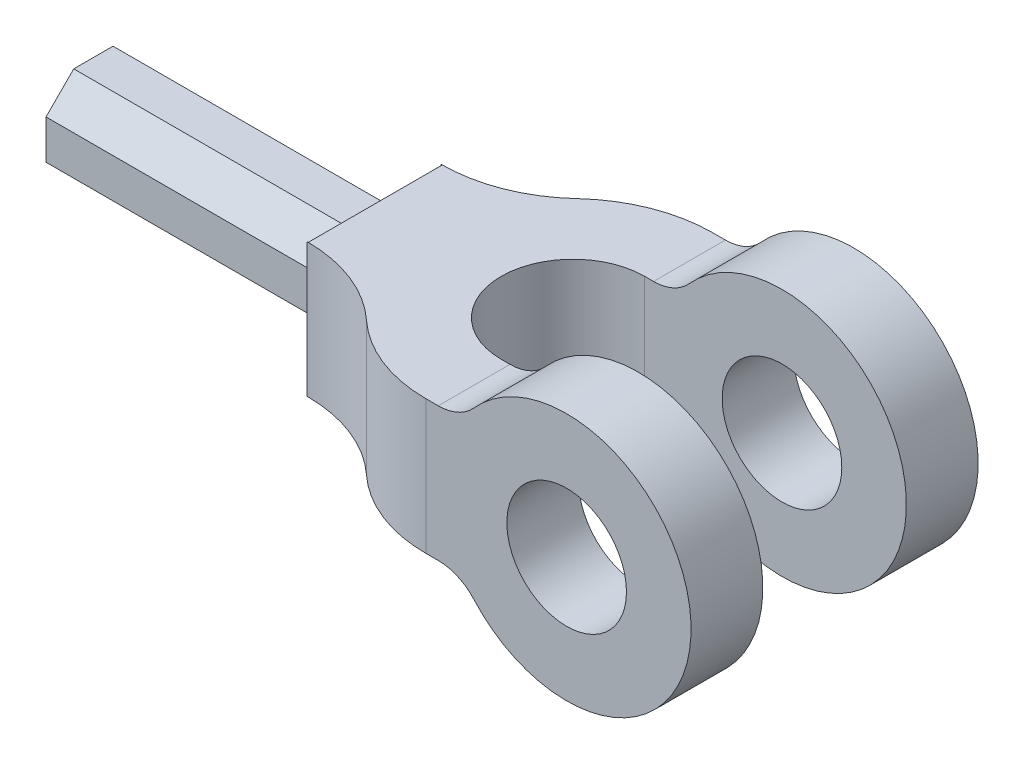
ISO-10303-21;
HEADER;
FILE_DESCRIPTION(('STEP AP214'),'2;1');
FILE_NAME('part.step','',(''),(''),'','','');
FILE_SCHEMA(('AUTOMOTIVE_DESIGN { 1 0 10303 214 1 1 1 1 }'));
ENDSEC;
DATA;
#1=APPLICATION_CONTEXT('core data for automotive mechanical design processes');
#2=APPLICATION_PROTOCOL_DEFINITION('international standard','automotive_design',2000,#1);
#3=PRODUCT_CONTEXT('',#1,'mechanical');
#4=PRODUCT('Part','Part','',(#3));
#5=PRODUCT_RELATED_PRODUCT_CATEGORY('part','',(#4));
#6=PRODUCT_DEFINITION_FORMATION('','',#4);
#7=PRODUCT_DEFINITION_CONTEXT('part definition',#1,'design');
#8=PRODUCT_DEFINITION('design','',#6,#7);
#9=PRODUCT_DEFINITION_SHAPE('','',#8);
#10=(LENGTH_UNIT() NAMED_UNIT(*) SI_UNIT(.MILLI.,.METRE.));
#11=(NAMED_UNIT(*) PLANE_ANGLE_UNIT() SI_UNIT($,.RADIAN.));
#12=(NAMED_UNIT(*) SI_UNIT($,.STERADIAN.) SOLID_ANGLE_UNIT());
#13=UNCERTAINTY_MEASURE_WITH_UNIT(LENGTH_MEASURE(1.E-05),#10,'distance_accuracy_value','');
#14=(GEOMETRIC_REPRESENTATION_CONTEXT(3) GLOBAL_UNCERTAINTY_ASSIGNED_CONTEXT((#13)) GLOBAL_UNIT_ASSIGNED_CONTEXT((#10,
#11,#12)) REPRESENTATION_CONTEXT('',''));
#15=CARTESIAN_POINT('',(0.,0.,0.));
#16=DIRECTION('',(0.,0.,1.));
#17=DIRECTION('',(1.,0.,0.));
#18=AXIS2_PLACEMENT_3D('',#15,#16,#17);
#19=CARTESIAN_POINT('',(0.,-14.000000000005,-60.));
#20=DIRECTION('',(0.,-1.,0.));
#21=DIRECTION('',(1.,0.,0.));
#22=AXIS2_PLACEMENT_3D('',#19,#20,#21);
#23=PLANE('',#22);
#24=DIRECTION('',(-1.,0.,0.));
#25=VECTOR('',#24,1.);
#26=CARTESIAN_POINT('',(60.,-14.000000000005,-44.));
#27=LINE('',#26,#25);
#28=CARTESIAN_POINT('',(60.,-14.000000000005,-44.));
#29=VERTEX_POINT('',#28);
#30=CARTESIAN_POINT('',(59.7773737746571,-14.000000000005,-44.));
#31=VERTEX_POINT('',#30);
#32=EDGE_CURVE('E294',#29,#31,#27,.T.);
#33=ORIENTED_EDGE('',*,*,#32,.T.);
#34=CARTESIAN_POINT('',(59.7773737746571,-14.000000000005,-74.));
#35=DIRECTION('',(0.,-1.,0.));
#36=DIRECTION('',(1.,0.,0.));
#37=AXIS2_PLACEMENT_3D('',#34,#35,#36);
#38=CIRCLE('',#37,30.);
#39=CARTESIAN_POINT('',(80.1734518290282,-14.000000000005,-52.));
#40=VERTEX_POINT('',#39);
#41=EDGE_CURVE('E407',#31,#40,#38,.F.);
#42=ORIENTED_EDGE('',*,*,#41,.T.);
#43=CARTESIAN_POINT('',(100.569529883399,-14.000000000005,-30.));
#44=DIRECTION('',(0.,-1.,0.));
#45=DIRECTION('',(1.,0.,0.));
#46=AXIS2_PLACEMENT_3D('',#43,#44,#45);
#47=CIRCLE('',#46,30.);
#48=CARTESIAN_POINT('',(100.569529883399,-14.000000000005,-60.));
#49=VERTEX_POINT('',#48);
#50=EDGE_CURVE('E58',#40,#49,#47,.T.);
#51=ORIENTED_EDGE('',*,*,#50,.T.);
#52=DIRECTION('',(1.,0.,0.));
#53=VECTOR('',#52,1.);
#54=CARTESIAN_POINT('',(0.,-14.000000000005,-60.));
#55=LINE('',#54,#53);
#56=CARTESIAN_POINT('',(103.167184270005,-14.000000000005,-60.));
#57=VERTEX_POINT('',#56);
#58=EDGE_CURVE('E358',#49,#57,#55,.T.);
#59=ORIENTED_EDGE('',*,*,#58,.T.);
#60=DIRECTION('',(0.,0.,1.));
#61=VECTOR('',#60,1.);
#62=CARTESIAN_POINT('',(103.167184270005,-14.000000000005,-60.));
#63=LINE('',#62,#61);
#64=CARTESIAN_POINT('',(103.167184270005,-14.000000000005,-45.));
#65=VERTEX_POINT('',#64);
#66=EDGE_CURVE('E373',#57,#65,#63,.T.);
#67=ORIENTED_EDGE('',*,*,#66,.T.);
#68=DIRECTION('',(-1.,0.,0.));
#69=VECTOR('',#68,1.);
#70=CARTESIAN_POINT('',(0.,-14.000000000005,-45.));
#71=LINE('',#70,#69);
#72=CARTESIAN_POINT('',(101.3103720975,-14.000000000005,-45.));
#73=VERTEX_POINT('',#72);
#74=EDGE_CURVE('E325',#65,#73,#71,.T.);
#75=ORIENTED_EDGE('',*,*,#74,.T.);
#76=CARTESIAN_POINT('',(101.3103720975,-14.000000000005,-30.));
#77=DIRECTION('',(0.,-1.,0.));
#78=DIRECTION('',(1.,0.,0.));
#79=AXIS2_PLACEMENT_3D('',#76,#77,#78);
#80=CIRCLE('',#79,15.);
#81=CARTESIAN_POINT('',(101.3103720975,-14.000000000005,-15.));
#82=VERTEX_POINT('',#81);
#83=EDGE_CURVE('E336',#82,#73,#80,.T.);
#84=ORIENTED_EDGE('',*,*,#83,.F.);
#85=DIRECTION('',(-1.,0.,0.));
#86=VECTOR('',#85,1.);
#87=CARTESIAN_POINT('',(0.,-14.000000000005,-15.));
#88=LINE('',#87,#86);
#89=CARTESIAN_POINT('',(103.167184270005,-14.000000000005,-15.));
#90=VERTEX_POINT('',#89);
#91=EDGE_CURVE('E314',#90,#82,#88,.T.);
#92=ORIENTED_EDGE('',*,*,#91,.F.);
#93=CARTESIAN_POINT('',(103.167184270005,-14.000000000005,0.));
#94=VERTEX_POINT('',#93);
#95=EDGE_CURVE('E377',#90,#94,#63,.T.);
#96=ORIENTED_EDGE('',*,*,#95,.T.);
#97=DIRECTION('',(1.,0.,0.));
#98=VECTOR('',#97,1.);
#99=CARTESIAN_POINT('',(0.,-14.000000000005,0.));
#100=LINE('',#99,#98);
#101=CARTESIAN_POINT('',(100.569529883399,-14.000000000005,0.));
#102=VERTEX_POINT('',#101);
#103=EDGE_CURVE('E349',#102,#94,#100,.T.);
#104=ORIENTED_EDGE('',*,*,#103,.F.);
#105=CARTESIAN_POINT('',(100.569529883399,-14.000000000005,-30.));
#106=DIRECTION('',(0.,-1.,0.));
#107=DIRECTION('',(1.,0.,0.));
#108=AXIS2_PLACEMENT_3D('',#105,#106,#107);
#109=CIRCLE('',#108,30.);
#110=CARTESIAN_POINT('',(80.1734518290282,-14.000000000005,-7.99999999999999));
#111=VERTEX_POINT('',#110);
#112=EDGE_CURVE('E419',#102,#111,#109,.T.);
#113=ORIENTED_EDGE('',*,*,#112,.T.);
#114=CARTESIAN_POINT('',(59.777373774657,-14.000000000005,14.));
#115=DIRECTION('',(0.,-1.,0.));
#116=DIRECTION('',(1.,0.,0.));
#117=AXIS2_PLACEMENT_3D('',#114,#115,#116);
#118=CIRCLE('',#117,30.);
#119=CARTESIAN_POINT('',(59.777373774657,-14.000000000005,-16.));
#120=VERTEX_POINT('',#119);
#121=EDGE_CURVE('E401',#111,#120,#118,.F.);
#122=ORIENTED_EDGE('',*,*,#121,.T.);
#123=DIRECTION('',(-1.,0.,0.));
#124=VECTOR('',#123,1.);
#125=CARTESIAN_POINT('',(60.,-14.000000000005,-16.));
#126=LINE('',#125,#124);
#127=CARTESIAN_POINT('',(60.,-14.000000000005,-16.));
#128=VERTEX_POINT('',#127);
#129=EDGE_CURVE('E301',#128,#120,#126,.T.);
#130=ORIENTED_EDGE('',*,*,#129,.F.);
#131=DIRECTION('',(0.,0.,1.));
#132=VECTOR('',#131,1.);
#133=CARTESIAN_POINT('',(60.,-14.000000000005,-44.));
#134=LINE('',#133,#132);
#135=EDGE_CURVE('E285',#29,#128,#134,.T.);
#136=ORIENTED_EDGE('',*,*,#135,.F.);
#137=EDGE_LOOP('',(#33,#42,#51,#59,#67,#75,#84,#92,#96,#104,#113,#122,#130,#136));
#138=FACE_BOUND('',#137,.T.);
#139=ADVANCED_FACE('F35',(#138),#23,.T.);
#140=CARTESIAN_POINT('',(0.,14.000000000005,-60.));
#141=DIRECTION('',(0.,1.,0.));
#142=DIRECTION('',(-1.,0.,0.));
#143=AXIS2_PLACEMENT_3D('',#140,#141,#142);
#144=PLANE('',#143);
#145=DIRECTION('',(-1.,0.,0.));
#146=VECTOR('',#145,1.);
#147=CARTESIAN_POINT('',(60.,14.000000000005,-44.));
#148=LINE('',#147,#146);
#149=CARTESIAN_POINT('',(60.,14.000000000005,-44.));
#150=VERTEX_POINT('',#149);
#151=CARTESIAN_POINT('',(59.7773737746571,14.000000000005,-44.));
#152=VERTEX_POINT('',#151);
#153=EDGE_CURVE('E295',#150,#152,#148,.T.);
#154=ORIENTED_EDGE('',*,*,#153,.F.);
#155=DIRECTION('',(0.,0.,-1.));
#156=VECTOR('',#155,1.);
#157=CARTESIAN_POINT('',(60.,14.000000000005,-44.));
#158=LINE('',#157,#156);
#159=CARTESIAN_POINT('',(60.,14.000000000005,-16.));
#160=VERTEX_POINT('',#159);
#161=EDGE_CURVE('E291',#160,#150,#158,.T.);
#162=ORIENTED_EDGE('',*,*,#161,.F.);
#163=DIRECTION('',(-1.,0.,0.));
#164=VECTOR('',#163,1.);
#165=CARTESIAN_POINT('',(60.,14.000000000005,-16.));
#166=LINE('',#165,#164);
#167=CARTESIAN_POINT('',(59.777373774657,14.000000000005,-16.));
#168=VERTEX_POINT('',#167);
#169=EDGE_CURVE('E298',#160,#168,#166,.T.);
#170=ORIENTED_EDGE('',*,*,#169,.T.);
#171=CARTESIAN_POINT('',(59.777373774657,14.000000000005,14.));
#172=DIRECTION('',(0.,1.,0.));
#173=DIRECTION('',(-1.,0.,0.));
#174=AXIS2_PLACEMENT_3D('',#171,#172,#173);
#175=CIRCLE('',#174,30.);
#176=CARTESIAN_POINT('',(80.1734518290282,14.000000000005,-7.99999999999999));
#177=VERTEX_POINT('',#176);
#178=EDGE_CURVE('E398',#168,#177,#175,.F.);
#179=ORIENTED_EDGE('',*,*,#178,.T.);
#180=CARTESIAN_POINT('',(100.569529883399,14.000000000005,-30.));
#181=DIRECTION('',(0.,1.,0.));
#182=DIRECTION('',(-1.,0.,0.));
#183=AXIS2_PLACEMENT_3D('',#180,#181,#182);
#184=CIRCLE('',#183,30.);
#185=CARTESIAN_POINT('',(100.569529883399,14.000000000005,0.));
#186=VERTEX_POINT('',#185);
#187=EDGE_CURVE('E414',#177,#186,#184,.T.);
#188=ORIENTED_EDGE('',*,*,#187,.T.);
#189=DIRECTION('',(-1.,0.,0.));
#190=VECTOR('',#189,1.);
#191=CARTESIAN_POINT('',(0.,14.000000000005,0.));
#192=LINE('',#191,#190);
#193=CARTESIAN_POINT('',(103.167184270005,14.000000000005,0.));
#194=VERTEX_POINT('',#193);
#195=EDGE_CURVE('E369',#194,#186,#192,.T.);
#196=ORIENTED_EDGE('',*,*,#195,.F.);
#197=DIRECTION('',(0.,0.,1.));
#198=VECTOR('',#197,1.);
#199=CARTESIAN_POINT('',(103.167184270005,14.000000000005,-60.));
#200=LINE('',#199,#198);
#201=CARTESIAN_POINT('',(103.167184270005,14.000000000005,-15.));
#202=VERTEX_POINT('',#201);
#203=EDGE_CURVE('E381',#202,#194,#200,.T.);
#204=ORIENTED_EDGE('',*,*,#203,.F.);
#205=DIRECTION('',(1.,0.,0.));
#206=VECTOR('',#205,1.);
#207=CARTESIAN_POINT('',(0.,14.000000000005,-15.));
#208=LINE('',#207,#206);
#209=CARTESIAN_POINT('',(101.3103720975,14.000000000005,-15.));
#210=VERTEX_POINT('',#209);
#211=EDGE_CURVE('E319',#210,#202,#208,.T.);
#212=ORIENTED_EDGE('',*,*,#211,.F.);
#213=CARTESIAN_POINT('',(101.3103720975,14.000000000005,-30.));
#214=DIRECTION('',(0.,1.,0.));
#215=DIRECTION('',(-1.,0.,0.));
#216=AXIS2_PLACEMENT_3D('',#213,#214,#215);
#217=CIRCLE('',#216,15.);
#218=CARTESIAN_POINT('',(101.3103720975,14.000000000005,-45.));
#219=VERTEX_POINT('',#218);
#220=EDGE_CURVE('E376',#219,#210,#217,.T.);
#221=ORIENTED_EDGE('',*,*,#220,.F.);
#222=DIRECTION('',(1.,0.,0.));
#223=VECTOR('',#222,1.);
#224=CARTESIAN_POINT('',(0.,14.000000000005,-45.));
#225=LINE('',#224,#223);
#226=CARTESIAN_POINT('',(103.167184270005,14.000000000005,-45.));
#227=VERTEX_POINT('',#226);
#228=EDGE_CURVE('E333',#219,#227,#225,.T.);
#229=ORIENTED_EDGE('',*,*,#228,.T.);
#230=CARTESIAN_POINT('',(103.167184270005,14.000000000005,-60.));
#231=VERTEX_POINT('',#230);
#232=EDGE_CURVE('E378',#231,#227,#200,.T.);
#233=ORIENTED_EDGE('',*,*,#232,.F.);
#234=DIRECTION('',(-1.,0.,0.));
#235=VECTOR('',#234,1.);
#236=CARTESIAN_POINT('',(0.,14.000000000005,-60.));
#237=LINE('',#236,#235);
#238=CARTESIAN_POINT('',(100.569529883399,14.000000000005,-60.));
#239=VERTEX_POINT('',#238);
#240=EDGE_CURVE('E355',#231,#239,#237,.T.);
#241=ORIENTED_EDGE('',*,*,#240,.T.);
#242=CARTESIAN_POINT('',(100.569529883399,14.000000000005,-30.));
#243=DIRECTION('',(0.,1.,0.));
#244=DIRECTION('',(-1.,0.,0.));
#245=AXIS2_PLACEMENT_3D('',#242,#243,#244);
#246=CIRCLE('',#245,30.);
#247=CARTESIAN_POINT('',(80.1734518290282,14.000000000005,-52.));
#248=VERTEX_POINT('',#247);
#249=EDGE_CURVE('E412',#239,#248,#246,.T.);
#250=ORIENTED_EDGE('',*,*,#249,.T.);
#251=CARTESIAN_POINT('',(59.7773737746571,14.000000000005,-74.));
#252=DIRECTION('',(0.,1.,0.));
#253=DIRECTION('',(-1.,0.,0.));
#254=AXIS2_PLACEMENT_3D('',#251,#252,#253);
#255=CIRCLE('',#254,30.);
#256=EDGE_CURVE('E404',#248,#152,#255,.F.);
#257=ORIENTED_EDGE('',*,*,#256,.T.);
#258=EDGE_LOOP('',(#154,#162,#170,#179,#188,#196,#204,#212,#221,#229,#233,#241,#250,#257));
#259=FACE_BOUND('',#258,.T.);
#260=ADVANCED_FACE('F430',(#259),#144,.T.);
#261=CARTESIAN_POINT('',(103.167184270005,-24.000000000005,0.));
#262=DIRECTION('',(0.,0.,-1.));
#263=DIRECTION('',(-1.,0.,0.));
#264=AXIS2_PLACEMENT_3D('',#261,#262,#263);
#265=PLANE('',#264);
#266=CARTESIAN_POINT('',(129.999999999998,0.,0.));
#267=DIRECTION('',(0.,0.,1.));
#268=DIRECTION('',(1.,0.,0.));
#269=AXIS2_PLACEMENT_3D('',#266,#267,#268);
#270=CIRCLE('',#269,12.5);
#271=CARTESIAN_POINT('',(142.499999999998,0.,0.));
#272=VERTEX_POINT('',#271);
#273=EDGE_CURVE('E338',#272,#272,#270,.T.);
#274=ORIENTED_EDGE('',*,*,#273,.F.);
#275=EDGE_LOOP('',(#274));
#276=FACE_BOUND('',#275,.T.);
#277=ORIENTED_EDGE('',*,*,#195,.T.);
#278=DIRECTION('',(0.,-1.,0.));
#279=VECTOR('',#278,1.);
#280=CARTESIAN_POINT('',(100.569529883399,-24.000000000005,0.));
#281=LINE('',#280,#279);
#282=EDGE_CURVE('E416',#186,#102,#281,.T.);
#283=ORIENTED_EDGE('',*,*,#282,.T.);
#284=ORIENTED_EDGE('',*,*,#103,.T.);
#285=CARTESIAN_POINT('',(103.167184270005,-24.000000000005,0.));
#286=DIRECTION('',(0.,0.,-1.));
#287=DIRECTION('',(-1.,0.,0.));
#288=AXIS2_PLACEMENT_3D('',#285,#286,#287);
#289=CIRCLE('',#288,10.);
#290=CARTESIAN_POINT('',(110.620744195003,-17.3333333333369,0.));
#291=VERTEX_POINT('',#290);
#292=EDGE_CURVE('E342',#94,#291,#289,.T.);
#293=ORIENTED_EDGE('',*,*,#292,.T.);
#294=CARTESIAN_POINT('',(129.999999999998,0.,0.));
#295=DIRECTION('',(0.,0.,1.));
#296=DIRECTION('',(1.,0.,0.));
#297=AXIS2_PLACEMENT_3D('',#294,#295,#296);
#298=CIRCLE('',#297,26.);
#299=CARTESIAN_POINT('',(110.620744195003,17.3333333333369,0.));
#300=VERTEX_POINT('',#299);
#301=EDGE_CURVE('E363',#291,#300,#298,.T.);
#302=ORIENTED_EDGE('',*,*,#301,.T.);
#303=CARTESIAN_POINT('',(103.167184270005,24.000000000005,0.));
#304=DIRECTION('',(0.,0.,-1.));
#305=DIRECTION('',(1.,0.,0.));
#306=AXIS2_PLACEMENT_3D('',#303,#304,#305);
#307=CIRCLE('',#306,10.);
#308=EDGE_CURVE('E366',#300,#194,#307,.T.);
#309=ORIENTED_EDGE('',*,*,#308,.T.);
#310=EDGE_LOOP('',(#277,#283,#284,#293,#302,#309));
#311=FACE_BOUND('',#310,.T.);
#312=ADVANCED_FACE('F508',(#276,#311),#265,.F.);
#313=CARTESIAN_POINT('',(103.167184270005,-24.000000000005,-60.));
#314=DIRECTION('',(0.,0.,-1.));
#315=DIRECTION('',(-1.,0.,0.));
#316=AXIS2_PLACEMENT_3D('',#313,#314,#315);
#317=PLANE('',#316);
#318=CARTESIAN_POINT('',(129.999999999998,0.,-60.));
#319=DIRECTION('',(0.,0.,1.));
#320=DIRECTION('',(1.,0.,0.));
#321=AXIS2_PLACEMENT_3D('',#318,#319,#320);
#322=CIRCLE('',#321,12.5);
#323=CARTESIAN_POINT('',(142.499999999998,0.,-60.));
#324=VERTEX_POINT('',#323);
#325=EDGE_CURVE('E339',#324,#324,#322,.T.);
#326=ORIENTED_EDGE('',*,*,#325,.T.);
#327=EDGE_LOOP('',(#326));
#328=FACE_BOUND('',#327,.T.);
#329=ORIENTED_EDGE('',*,*,#58,.F.);
#330=DIRECTION('',(0.,1.,0.));
#331=VECTOR('',#330,1.);
#332=CARTESIAN_POINT('',(100.569529883399,14.000000000005,-60.));
#333=LINE('',#332,#331);
#334=EDGE_CURVE('E43',#49,#239,#333,.T.);
#335=ORIENTED_EDGE('',*,*,#334,.T.);
#336=ORIENTED_EDGE('',*,*,#240,.F.);
#337=CARTESIAN_POINT('',(103.167184270005,24.000000000005,-60.));
#338=DIRECTION('',(0.,0.,-1.));
#339=DIRECTION('',(1.,0.,0.));
#340=AXIS2_PLACEMENT_3D('',#337,#338,#339);
#341=CIRCLE('',#340,10.);
#342=CARTESIAN_POINT('',(110.620744195003,17.3333333333369,-60.));
#343=VERTEX_POINT('',#342);
#344=EDGE_CURVE('E352',#343,#231,#341,.T.);
#345=ORIENTED_EDGE('',*,*,#344,.F.);
#346=CARTESIAN_POINT('',(129.999999999998,0.,-60.));
#347=DIRECTION('',(0.,0.,1.));
#348=DIRECTION('',(1.,0.,0.));
#349=AXIS2_PLACEMENT_3D('',#346,#347,#348);
#350=CIRCLE('',#349,26.);
#351=CARTESIAN_POINT('',(110.620744195003,-17.3333333333369,-60.));
#352=VERTEX_POINT('',#351);
#353=EDGE_CURVE('E348',#352,#343,#350,.T.);
#354=ORIENTED_EDGE('',*,*,#353,.F.);
#355=CARTESIAN_POINT('',(103.167184270005,-24.000000000005,-60.));
#356=DIRECTION('',(0.,0.,-1.));
#357=DIRECTION('',(-1.,0.,0.));
#358=AXIS2_PLACEMENT_3D('',#355,#356,#357);
#359=CIRCLE('',#358,10.);
#360=EDGE_CURVE('E345',#57,#352,#359,.T.);
#361=ORIENTED_EDGE('',*,*,#360,.F.);
#362=EDGE_LOOP('',(#329,#335,#336,#345,#354,#361));
#363=FACE_BOUND('',#362,.T.);
#364=ADVANCED_FACE('F424',(#328,#363),#317,.T.);
#365=CARTESIAN_POINT('',(129.999999999998,0.,-60.));
#366=DIRECTION('',(0.,0.,1.));
#367=DIRECTION('',(1.,0.,0.));
#368=AXIS2_PLACEMENT_3D('',#365,#366,#367);
#369=CYLINDRICAL_SURFACE('',#368,26.);
#370=DIRECTION('',(0.,0.,1.));
#371=VECTOR('',#370,1.);
#372=CARTESIAN_POINT('',(110.620744195003,-17.3333333333369,-60.));
#373=LINE('',#372,#371);
#374=CARTESIAN_POINT('',(110.620744195003,-17.3333333333369,-15.));
#375=VERTEX_POINT('',#374);
#376=EDGE_CURVE('E360',#375,#291,#373,.T.);
#377=ORIENTED_EDGE('',*,*,#376,.F.);
#378=CARTESIAN_POINT('',(129.999999999998,0.,-15.));
#379=DIRECTION('',(0.,0.,1.));
#380=DIRECTION('',(1.,0.,0.));
#381=AXIS2_PLACEMENT_3D('',#378,#379,#380);
#382=CIRCLE('',#381,26.);
#383=CARTESIAN_POINT('',(110.620744195003,17.3333333333369,-15.));
#384=VERTEX_POINT('',#383);
#385=EDGE_CURVE('E311',#384,#375,#382,.F.);
#386=ORIENTED_EDGE('',*,*,#385,.F.);
#387=DIRECTION('',(0.,0.,1.));
#388=VECTOR('',#387,1.);
#389=CARTESIAN_POINT('',(110.620744195003,17.3333333333369,-60.));
#390=LINE('',#389,#388);
#391=EDGE_CURVE('E385',#384,#300,#390,.T.);
#392=ORIENTED_EDGE('',*,*,#391,.T.);
#393=ORIENTED_EDGE('',*,*,#301,.F.);
#394=EDGE_LOOP('',(#377,#386,#392,#393));
#395=FACE_BOUND('',#394,.T.);
#396=ADVANCED_FACE('F466',(#395),#369,.T.);
#397=CARTESIAN_POINT('',(103.167184270005,-24.000000000005,-60.));
#398=DIRECTION('',(0.,0.,1.));
#399=DIRECTION('',(1.,0.,0.));
#400=AXIS2_PLACEMENT_3D('',#397,#398,#399);
#401=CYLINDRICAL_SURFACE('',#400,10.);
#402=CARTESIAN_POINT('',(110.620744195003,-17.3333333333369,-45.));
#403=VERTEX_POINT('',#402);
#404=EDGE_CURVE('E386',#352,#403,#373,.T.);
#405=ORIENTED_EDGE('',*,*,#404,.T.);
#406=CARTESIAN_POINT('',(103.167184270005,-24.000000000005,-45.));
#407=DIRECTION('',(0.,0.,1.));
#408=DIRECTION('',(1.,0.,0.));
#409=AXIS2_PLACEMENT_3D('',#406,#407,#408);
#410=CIRCLE('',#409,10.);
#411=EDGE_CURVE('E326',#403,#65,#410,.T.);
#412=ORIENTED_EDGE('',*,*,#411,.T.);
#413=ORIENTED_EDGE('',*,*,#66,.F.);
#414=ORIENTED_EDGE('',*,*,#360,.T.);
#415=EDGE_LOOP('',(#405,#412,#413,#414));
#416=FACE_BOUND('',#415,.T.);
#417=ADVANCED_FACE('F440',(#416),#401,.F.);
#418=CARTESIAN_POINT('',(103.167184270005,24.000000000005,-60.));
#419=DIRECTION('',(0.,0.,1.));
#420=DIRECTION('',(1.,0.,0.));
#421=AXIS2_PLACEMENT_3D('',#418,#419,#420);
#422=CYLINDRICAL_SURFACE('',#421,10.);
#423=ORIENTED_EDGE('',*,*,#232,.T.);
#424=CARTESIAN_POINT('',(103.167184270005,24.000000000005,-45.));
#425=DIRECTION('',(0.,0.,1.));
#426=DIRECTION('',(1.,0.,0.));
#427=AXIS2_PLACEMENT_3D('',#424,#425,#426);
#428=CIRCLE('',#427,10.);
#429=CARTESIAN_POINT('',(110.620744195003,17.3333333333369,-45.));
#430=VERTEX_POINT('',#429);
#431=EDGE_CURVE('E324',#227,#430,#428,.T.);
#432=ORIENTED_EDGE('',*,*,#431,.T.);
#433=EDGE_CURVE('E382',#343,#430,#390,.T.);
#434=ORIENTED_EDGE('',*,*,#433,.F.);
#435=ORIENTED_EDGE('',*,*,#344,.T.);
#436=EDGE_LOOP('',(#423,#432,#434,#435));
#437=FACE_BOUND('',#436,.T.);
#438=ADVANCED_FACE('F434',(#437),#422,.F.);
#439=CARTESIAN_POINT('',(129.999999999998,0.,-45.));
#440=DIRECTION('',(0.,0.,1.));
#441=DIRECTION('',(1.,0.,0.));
#442=AXIS2_PLACEMENT_3D('',#439,#440,#441);
#443=CIRCLE('',#442,26.);
#444=EDGE_CURVE('E322',#430,#403,#443,.F.);
#445=ORIENTED_EDGE('',*,*,#444,.T.);
#446=ORIENTED_EDGE('',*,*,#404,.F.);
#447=ORIENTED_EDGE('',*,*,#353,.T.);
#448=ORIENTED_EDGE('',*,*,#433,.T.);
#449=EDGE_LOOP('',(#445,#446,#447,#448));
#450=FACE_BOUND('',#449,.T.);
#451=ADVANCED_FACE('F437',(#450),#369,.T.);
#452=CARTESIAN_POINT('',(129.999999999998,0.,-60.));
#453=DIRECTION('',(0.,0.,1.));
#454=DIRECTION('',(1.,0.,0.));
#455=AXIS2_PLACEMENT_3D('',#452,#453,#454);
#456=CYLINDRICAL_SURFACE('',#455,12.5);
#457=ORIENTED_EDGE('',*,*,#325,.F.);
#458=EDGE_LOOP('',(#457));
#459=FACE_BOUND('',#458,.T.);
#460=CARTESIAN_POINT('',(129.999999999998,0.,-45.));
#461=DIRECTION('',(0.,0.,1.));
#462=DIRECTION('',(1.,0.,0.));
#463=AXIS2_PLACEMENT_3D('',#460,#461,#462);
#464=CIRCLE('',#463,12.5);
#465=CARTESIAN_POINT('',(142.499999999998,0.,-45.));
#466=VERTEX_POINT('',#465);
#467=EDGE_CURVE('E321',#466,#466,#464,.F.);
#468=ORIENTED_EDGE('',*,*,#467,.F.);
#469=EDGE_LOOP('',(#468));
#470=FACE_BOUND('',#469,.T.);
#471=ADVANCED_FACE('F522',(#459,#470),#456,.F.);
#472=CARTESIAN_POINT('',(103.167184270005,-24.000000000005,-15.));
#473=DIRECTION('',(0.,0.,1.));
#474=DIRECTION('',(1.,0.,0.));
#475=AXIS2_PLACEMENT_3D('',#472,#473,#474);
#476=CIRCLE('',#475,10.);
#477=EDGE_CURVE('E315',#375,#90,#476,.T.);
#478=ORIENTED_EDGE('',*,*,#477,.F.);
#479=ORIENTED_EDGE('',*,*,#376,.T.);
#480=ORIENTED_EDGE('',*,*,#292,.F.);
#481=ORIENTED_EDGE('',*,*,#95,.F.);
#482=EDGE_LOOP('',(#478,#479,#480,#481));
#483=FACE_BOUND('',#482,.T.);
#484=ADVANCED_FACE('F470',(#483),#401,.F.);
#485=CARTESIAN_POINT('',(103.167184270005,24.000000000005,-15.));
#486=DIRECTION('',(0.,0.,1.));
#487=DIRECTION('',(1.,0.,0.));
#488=AXIS2_PLACEMENT_3D('',#485,#486,#487);
#489=CIRCLE('',#488,10.);
#490=EDGE_CURVE('E313',#202,#384,#489,.T.);
#491=ORIENTED_EDGE('',*,*,#490,.F.);
#492=ORIENTED_EDGE('',*,*,#203,.T.);
#493=ORIENTED_EDGE('',*,*,#308,.F.);
#494=ORIENTED_EDGE('',*,*,#391,.F.);
#495=EDGE_LOOP('',(#491,#492,#493,#494));
#496=FACE_BOUND('',#495,.T.);
#497=ADVANCED_FACE('F461',(#496),#422,.F.);
#498=CARTESIAN_POINT('',(129.999999999998,0.,-15.));
#499=DIRECTION('',(0.,0.,1.));
#500=DIRECTION('',(1.,0.,0.));
#501=AXIS2_PLACEMENT_3D('',#498,#499,#500);
#502=CIRCLE('',#501,12.5);
#503=CARTESIAN_POINT('',(142.499999999998,0.,-15.));
#504=VERTEX_POINT('',#503);
#505=EDGE_CURVE('E308',#504,#504,#502,.F.);
#506=ORIENTED_EDGE('',*,*,#505,.T.);
#507=EDGE_LOOP('',(#506));
#508=FACE_BOUND('',#507,.T.);
#509=ORIENTED_EDGE('',*,*,#273,.T.);
#510=EDGE_LOOP('',(#509));
#511=FACE_BOUND('',#510,.T.);
#512=ADVANCED_FACE('F519',(#508,#511),#456,.F.);
#513=CARTESIAN_POINT('',(101.3103720975,-40.,-45.));
#514=DIRECTION('',(0.,0.,1.));
#515=DIRECTION('',(1.,0.,0.));
#516=AXIS2_PLACEMENT_3D('',#513,#514,#515);
#517=PLANE('',#516);
#518=DIRECTION('',(0.,1.,0.));
#519=VECTOR('',#518,1.);
#520=CARTESIAN_POINT('',(101.3103720975,-40.,-45.));
#521=LINE('',#520,#519);
#522=EDGE_CURVE('E305',#73,#219,#521,.T.);
#523=ORIENTED_EDGE('',*,*,#522,.F.);
#524=ORIENTED_EDGE('',*,*,#74,.F.);
#525=ORIENTED_EDGE('',*,*,#411,.F.);
#526=ORIENTED_EDGE('',*,*,#444,.F.);
#527=ORIENTED_EDGE('',*,*,#431,.F.);
#528=ORIENTED_EDGE('',*,*,#228,.F.);
#529=EDGE_LOOP('',(#523,#524,#525,#526,#527,#528));
#530=FACE_BOUND('',#529,.T.);
#531=ORIENTED_EDGE('',*,*,#467,.T.);
#532=EDGE_LOOP('',(#531));
#533=FACE_BOUND('',#532,.T.);
#534=ADVANCED_FACE('F446',(#530,#533),#517,.T.);
#535=CARTESIAN_POINT('',(101.3103720975,-40.,-15.));
#536=DIRECTION('',(0.,0.,1.));
#537=DIRECTION('',(1.,0.,0.));
#538=AXIS2_PLACEMENT_3D('',#535,#536,#537);
#539=PLANE('',#538);
#540=ORIENTED_EDGE('',*,*,#211,.T.);
#541=ORIENTED_EDGE('',*,*,#490,.T.);
#542=ORIENTED_EDGE('',*,*,#385,.T.);
#543=ORIENTED_EDGE('',*,*,#477,.T.);
#544=ORIENTED_EDGE('',*,*,#91,.T.);
#545=DIRECTION('',(0.,1.,0.));
#546=VECTOR('',#545,1.);
#547=CARTESIAN_POINT('',(101.3103720975,-40.,-15.));
#548=LINE('',#547,#546);
#549=EDGE_CURVE('E297',#82,#210,#548,.T.);
#550=ORIENTED_EDGE('',*,*,#549,.T.);
#551=EDGE_LOOP('',(#540,#541,#542,#543,#544,#550));
#552=FACE_BOUND('',#551,.T.);
#553=ORIENTED_EDGE('',*,*,#505,.F.);
#554=EDGE_LOOP('',(#553));
#555=FACE_BOUND('',#554,.T.);
#556=ADVANCED_FACE('F456',(#552,#555),#539,.F.);
#557=CARTESIAN_POINT('',(101.3103720975,-40.,-30.));
#558=DIRECTION('',(0.,1.,0.));
#559=DIRECTION('',(0.,0.,1.));
#560=AXIS2_PLACEMENT_3D('',#557,#558,#559);
#561=CYLINDRICAL_SURFACE('',#560,15.);
#562=ORIENTED_EDGE('',*,*,#83,.T.);
#563=ORIENTED_EDGE('',*,*,#522,.T.);
#564=ORIENTED_EDGE('',*,*,#220,.T.);
#565=ORIENTED_EDGE('',*,*,#549,.F.);
#566=EDGE_LOOP('',(#562,#563,#564,#565));
#567=FACE_BOUND('',#566,.T.);
#568=ADVANCED_FACE('F449',(#567),#561,.F.);
#569=CARTESIAN_POINT('',(59.777373774657,-40.,14.));
#570=DIRECTION('',(0.,-1.,0.));
#571=DIRECTION('',(0.,0.,-1.));
#572=AXIS2_PLACEMENT_3D('',#569,#570,#571);
#573=CYLINDRICAL_SURFACE('',#572,30.);
#574=ORIENTED_EDGE('',*,*,#121,.F.);
#575=DIRECTION('',(0.,-1.,0.));
#576=VECTOR('',#575,1.);
#577=CARTESIAN_POINT('',(80.1734518290282,-40.,-8.));
#578=LINE('',#577,#576);
#579=EDGE_CURVE('E409',#111,#177,#578,.F.);
#580=ORIENTED_EDGE('',*,*,#579,.T.);
#581=ORIENTED_EDGE('',*,*,#178,.F.);
#582=DIRECTION('',(0.,1.,0.));
#583=VECTOR('',#582,1.);
#584=CARTESIAN_POINT('',(59.777373774657,14.000000000005,-16.));
#585=LINE('',#584,#583);
#586=EDGE_CURVE('E394',#120,#168,#585,.T.);
#587=ORIENTED_EDGE('',*,*,#586,.F.);
#588=EDGE_LOOP('',(#574,#580,#581,#587));
#589=FACE_BOUND('',#588,.T.);
#590=ADVANCED_FACE('F483',(#589),#573,.F.);
#591=CARTESIAN_POINT('',(59.7773737746571,-40.,-74.));
#592=DIRECTION('',(0.,-1.,0.));
#593=DIRECTION('',(0.,0.,-1.));
#594=AXIS2_PLACEMENT_3D('',#591,#592,#593);
#595=CYLINDRICAL_SURFACE('',#594,30.);
#596=ORIENTED_EDGE('',*,*,#256,.F.);
#597=DIRECTION('',(0.,-1.,0.));
#598=VECTOR('',#597,1.);
#599=CARTESIAN_POINT('',(80.1734518290282,-40.,-52.));
#600=LINE('',#599,#598);
#601=EDGE_CURVE('E11',#248,#40,#600,.T.);
#602=ORIENTED_EDGE('',*,*,#601,.T.);
#603=ORIENTED_EDGE('',*,*,#41,.F.);
#604=DIRECTION('',(0.,-1.,0.));
#605=VECTOR('',#604,1.);
#606=CARTESIAN_POINT('',(59.7773737746571,-40.,-44.));
#607=LINE('',#606,#605);
#608=EDGE_CURVE('E396',#152,#31,#607,.T.);
#609=ORIENTED_EDGE('',*,*,#608,.F.);
#610=EDGE_LOOP('',(#596,#602,#603,#609));
#611=FACE_BOUND('',#610,.T.);
#612=ADVANCED_FACE('F494',(#611),#595,.F.);
#613=CARTESIAN_POINT('',(100.569529883399,-40.,-30.));
#614=DIRECTION('',(0.,-1.,0.));
#615=DIRECTION('',(0.,0.,-1.));
#616=AXIS2_PLACEMENT_3D('',#613,#614,#615);
#617=CYLINDRICAL_SURFACE('',#616,30.);
#618=ORIENTED_EDGE('',*,*,#112,.F.);
#619=ORIENTED_EDGE('',*,*,#282,.F.);
#620=ORIENTED_EDGE('',*,*,#187,.F.);
#621=ORIENTED_EDGE('',*,*,#579,.F.);
#622=EDGE_LOOP('',(#618,#619,#620,#621));
#623=FACE_BOUND('',#622,.T.);
#624=ADVANCED_FACE('F480',(#623),#617,.T.);
#625=CARTESIAN_POINT('',(100.569529883399,-40.,-30.));
#626=DIRECTION('',(0.,-1.,0.));
#627=DIRECTION('',(0.,0.,-1.));
#628=AXIS2_PLACEMENT_3D('',#625,#626,#627);
#629=CYLINDRICAL_SURFACE('',#628,30.);
#630=ORIENTED_EDGE('',*,*,#50,.F.);
#631=ORIENTED_EDGE('',*,*,#601,.F.);
#632=ORIENTED_EDGE('',*,*,#249,.F.);
#633=ORIENTED_EDGE('',*,*,#334,.F.);
#634=EDGE_LOOP('',(#630,#631,#632,#633));
#635=FACE_BOUND('',#634,.T.);
#636=ADVANCED_FACE('F37',(#635),#629,.T.);
#637=CARTESIAN_POINT('',(60.,14.000000000005,-44.));
#638=DIRECTION('',(0.,0.,-1.));
#639=DIRECTION('',(-1.,0.,0.));
#640=AXIS2_PLACEMENT_3D('',#637,#638,#639);
#641=PLANE('',#640);
#642=ORIENTED_EDGE('',*,*,#32,.F.);
#643=DIRECTION('',(0.,-1.,0.));
#644=VECTOR('',#643,1.);
#645=CARTESIAN_POINT('',(60.,14.000000000005,-44.));
#646=LINE('',#645,#644);
#647=EDGE_CURVE('E271',#150,#29,#646,.T.);
#648=ORIENTED_EDGE('',*,*,#647,.F.);
#649=ORIENTED_EDGE('',*,*,#153,.T.);
#650=ORIENTED_EDGE('',*,*,#608,.T.);
#651=EDGE_LOOP('',(#642,#648,#649,#650));
#652=FACE_BOUND('',#651,.T.);
#653=ADVANCED_FACE('F497',(#652),#641,.F.);
#654=CARTESIAN_POINT('',(60.,-14.000000000005,-16.));
#655=DIRECTION('',(0.,0.,1.));
#656=DIRECTION('',(1.,0.,0.));
#657=AXIS2_PLACEMENT_3D('',#654,#655,#656);
#658=PLANE('',#657);
#659=ORIENTED_EDGE('',*,*,#586,.T.);
#660=ORIENTED_EDGE('',*,*,#169,.F.);
#661=DIRECTION('',(0.,1.,0.));
#662=VECTOR('',#661,1.);
#663=CARTESIAN_POINT('',(60.,-14.000000000005,-16.));
#664=LINE('',#663,#662);
#665=EDGE_CURVE('E288',#128,#160,#664,.T.);
#666=ORIENTED_EDGE('',*,*,#665,.F.);
#667=ORIENTED_EDGE('',*,*,#129,.T.);
#668=EDGE_LOOP('',(#659,#660,#666,#667));
#669=FACE_BOUND('',#668,.T.);
#670=ADVANCED_FACE('F487',(#669),#658,.F.);
#671=CARTESIAN_POINT('',(60.,0.,0.));
#672=DIRECTION('',(-1.,0.,0.));
#673=DIRECTION('',(0.,0.,1.));
#674=AXIS2_PLACEMENT_3D('',#671,#672,#673);
#675=PLANE('',#674);
#676=DIRECTION('',(0.,0.707106781186548,0.707106781186547));
#677=VECTOR('',#676,1.);
#678=CARTESIAN_POINT('',(60.,-9.90270570860483,-26.9954592827015));
#679=LINE('',#678,#677);
#680=CARTESIAN_POINT('',(60.,-9.90270570860483,-26.9954592827015));
#681=VERTEX_POINT('',#680);
#682=CARTESIAN_POINT('',(60.,-4.1018350086936,-21.1945885827903));
#683=VERTEX_POINT('',#682);
#684=EDGE_CURVE('E220',#681,#683,#679,.T.);
#685=ORIENTED_EDGE('',*,*,#684,.F.);
#686=DIRECTION('',(0.,0.,1.));
#687=VECTOR('',#686,1.);
#688=CARTESIAN_POINT('',(60.,-9.90270570860484,-35.1991293000887));
#689=LINE('',#688,#687);
#690=CARTESIAN_POINT('',(60.,-9.90270570860484,-35.1991293000887));
#691=VERTEX_POINT('',#690);
#692=EDGE_CURVE('E251',#691,#681,#689,.T.);
#693=ORIENTED_EDGE('',*,*,#692,.F.);
#694=DIRECTION('',(0.,-0.707106781186547,0.707106781186548));
#695=VECTOR('',#694,1.);
#696=CARTESIAN_POINT('',(60.,-4.10183500869359,-41.));
#697=LINE('',#696,#695);
#698=CARTESIAN_POINT('',(60.,-4.10183500869359,-41.));
#699=VERTEX_POINT('',#698);
#700=EDGE_CURVE('E248',#699,#691,#697,.T.);
#701=ORIENTED_EDGE('',*,*,#700,.F.);
#702=DIRECTION('',(0.,-1.,0.));
#703=VECTOR('',#702,1.);
#704=CARTESIAN_POINT('',(60.,4.10183500869359,-41.));
#705=LINE('',#704,#703);
#706=CARTESIAN_POINT('',(60.,4.10183500869359,-41.));
#707=VERTEX_POINT('',#706);
#708=EDGE_CURVE('E245',#707,#699,#705,.T.);
#709=ORIENTED_EDGE('',*,*,#708,.F.);
#710=DIRECTION('',(0.,-0.707106781186548,-0.707106781186547));
#711=VECTOR('',#710,1.);
#712=CARTESIAN_POINT('',(60.,9.90270570860483,-35.1991293000888));
#713=LINE('',#712,#711);
#714=CARTESIAN_POINT('',(60.,9.90270570860483,-35.1991293000888));
#715=VERTEX_POINT('',#714);
#716=EDGE_CURVE('E242',#715,#707,#713,.T.);
#717=ORIENTED_EDGE('',*,*,#716,.F.);
#718=DIRECTION('',(0.,0.,-1.));
#719=VECTOR('',#718,1.);
#720=CARTESIAN_POINT('',(60.,9.90270570860483,-26.9954592827016));
#721=LINE('',#720,#719);
#722=CARTESIAN_POINT('',(60.,9.90270570860484,-26.9954592827016));
#723=VERTEX_POINT('',#722);
#724=EDGE_CURVE('E231',#723,#715,#721,.T.);
#725=ORIENTED_EDGE('',*,*,#724,.F.);
#726=DIRECTION('',(0.,0.707106781186547,-0.707106781186548));
#727=VECTOR('',#726,1.);
#728=CARTESIAN_POINT('',(60.,4.10183500869359,-21.1945885827903));
#729=LINE('',#728,#727);
#730=CARTESIAN_POINT('',(60.,4.10183500869359,-21.1945885827903));
#731=VERTEX_POINT('',#730);
#732=EDGE_CURVE('E212',#731,#723,#729,.T.);
#733=ORIENTED_EDGE('',*,*,#732,.F.);
#734=DIRECTION('',(0.,1.,0.));
#735=VECTOR('',#734,1.);
#736=CARTESIAN_POINT('',(60.,-4.1018350086936,-21.1945885827903));
#737=LINE('',#736,#735);
#738=EDGE_CURVE('E227',#683,#731,#737,.T.);
#739=ORIENTED_EDGE('',*,*,#738,.F.);
#740=EDGE_LOOP('',(#685,#693,#701,#709,#717,#725,#733,#739));
#741=FACE_BOUND('',#740,.T.);
#742=ORIENTED_EDGE('',*,*,#647,.T.);
#743=ORIENTED_EDGE('',*,*,#135,.T.);
#744=ORIENTED_EDGE('',*,*,#665,.T.);
#745=ORIENTED_EDGE('',*,*,#161,.T.);
#746=EDGE_LOOP('',(#742,#743,#744,#745));
#747=FACE_BOUND('',#746,.T.);
#748=ADVANCED_FACE('F225',(#741,#747),#675,.T.);
#749=CARTESIAN_POINT('',(60.,-4.1018350086936,-21.1945885827903));
#750=DIRECTION('',(0.,0.,1.));
#751=DIRECTION('',(0.,-1.,0.));
#752=AXIS2_PLACEMENT_3D('',#749,#750,#751);
#753=PLANE('',#752);
#754=DIRECTION('',(0.,1.,0.));
#755=VECTOR('',#754,1.);
#756=CARTESIAN_POINT('',(0.,-4.1018350086936,-21.1945885827903));
#757=LINE('',#756,#755);
#758=CARTESIAN_POINT('',(0.,-4.1018350086936,-21.1945885827903));
#759=VERTEX_POINT('',#758);
#760=CARTESIAN_POINT('',(0.,4.10183500869359,-21.1945885827903));
#761=VERTEX_POINT('',#760);
#762=EDGE_CURVE('E255',#759,#761,#757,.T.);
#763=ORIENTED_EDGE('',*,*,#762,.F.);
#764=DIRECTION('',(-1.,0.,0.));
#765=VECTOR('',#764,1.);
#766=CARTESIAN_POINT('',(60.,-4.1018350086936,-21.1945885827903));
#767=LINE('',#766,#765);
#768=EDGE_CURVE('E234',#683,#759,#767,.T.);
#769=ORIENTED_EDGE('',*,*,#768,.F.);
#770=ORIENTED_EDGE('',*,*,#738,.T.);
#771=DIRECTION('',(-1.,0.,0.));
#772=VECTOR('',#771,1.);
#773=CARTESIAN_POINT('',(60.,4.10183500869359,-21.1945885827903));
#774=LINE('',#773,#772);
#775=EDGE_CURVE('E209',#731,#761,#774,.T.);
#776=ORIENTED_EDGE('',*,*,#775,.T.);
#777=EDGE_LOOP('',(#763,#769,#770,#776));
#778=FACE_BOUND('',#777,.T.);
#779=ADVANCED_FACE('F233',(#778),#753,.T.);
#780=CARTESIAN_POINT('',(60.,-9.90270570860483,-26.9954592827015));
#781=DIRECTION('',(0.,-0.707106781186547,0.707106781186548));
#782=DIRECTION('',(0.,-0.707106781186548,-0.707106781186547));
#783=AXIS2_PLACEMENT_3D('',#780,#781,#782);
#784=PLANE('',#783);
#785=DIRECTION('',(0.,0.707106781186548,0.707106781186547));
#786=VECTOR('',#785,1.);
#787=CARTESIAN_POINT('',(0.,-9.90270570860483,-26.9954592827015));
#788=LINE('',#787,#786);
#789=CARTESIAN_POINT('',(0.,-9.90270570860483,-26.9954592827015));
#790=VERTEX_POINT('',#789);
#791=EDGE_CURVE('E235',#790,#759,#788,.T.);
#792=ORIENTED_EDGE('',*,*,#791,.F.);
#793=DIRECTION('',(-1.,0.,0.));
#794=VECTOR('',#793,1.);
#795=CARTESIAN_POINT('',(60.,-9.90270570860483,-26.9954592827015));
#796=LINE('',#795,#794);
#797=EDGE_CURVE('E272',#681,#790,#796,.T.);
#798=ORIENTED_EDGE('',*,*,#797,.F.);
#799=ORIENTED_EDGE('',*,*,#684,.T.);
#800=ORIENTED_EDGE('',*,*,#768,.T.);
#801=EDGE_LOOP('',(#792,#798,#799,#800));
#802=FACE_BOUND('',#801,.T.);
#803=ADVANCED_FACE('F671',(#802),#784,.T.);
#804=CARTESIAN_POINT('',(60.,-9.90270570860484,-35.1991293000887));
#805=DIRECTION('',(0.,-1.,0.));
#806=DIRECTION('',(0.,0.,-1.));
#807=AXIS2_PLACEMENT_3D('',#804,#805,#806);
#808=PLANE('',#807);
#809=DIRECTION('',(0.,0.,1.));
#810=VECTOR('',#809,1.);
#811=CARTESIAN_POINT('',(0.,-9.90270570860484,-35.1991293000887));
#812=LINE('',#811,#810);
#813=CARTESIAN_POINT('',(0.,-9.90270570860484,-35.1991293000887));
#814=VERTEX_POINT('',#813);
#815=EDGE_CURVE('E238',#814,#790,#812,.T.);
#816=ORIENTED_EDGE('',*,*,#815,.F.);
#817=DIRECTION('',(-1.,0.,0.));
#818=VECTOR('',#817,1.);
#819=CARTESIAN_POINT('',(60.,-9.90270570860484,-35.1991293000887));
#820=LINE('',#819,#818);
#821=EDGE_CURVE('E274',#691,#814,#820,.T.);
#822=ORIENTED_EDGE('',*,*,#821,.F.);
#823=ORIENTED_EDGE('',*,*,#692,.T.);
#824=ORIENTED_EDGE('',*,*,#797,.T.);
#825=EDGE_LOOP('',(#816,#822,#823,#824));
#826=FACE_BOUND('',#825,.T.);
#827=ADVANCED_FACE('F688',(#826),#808,.T.);
#828=CARTESIAN_POINT('',(60.,-4.10183500869359,-41.));
#829=DIRECTION('',(0.,-0.707106781186548,-0.707106781186547));
#830=DIRECTION('',(0.,0.707106781186547,-0.707106781186548));
#831=AXIS2_PLACEMENT_3D('',#828,#829,#830);
#832=PLANE('',#831);
#833=DIRECTION('',(0.,-0.707106781186547,0.707106781186548));
#834=VECTOR('',#833,1.);
#835=CARTESIAN_POINT('',(0.,-4.10183500869359,-41.));
#836=LINE('',#835,#834);
#837=CARTESIAN_POINT('',(0.,-4.10183500869359,-41.));
#838=VERTEX_POINT('',#837);
#839=EDGE_CURVE('E265',#838,#814,#836,.T.);
#840=ORIENTED_EDGE('',*,*,#839,.F.);
#841=DIRECTION('',(-1.,0.,0.));
#842=VECTOR('',#841,1.);
#843=CARTESIAN_POINT('',(60.,-4.10183500869359,-41.));
#844=LINE('',#843,#842);
#845=EDGE_CURVE('E276',#699,#838,#844,.T.);
#846=ORIENTED_EDGE('',*,*,#845,.F.);
#847=ORIENTED_EDGE('',*,*,#700,.T.);
#848=ORIENTED_EDGE('',*,*,#821,.T.);
#849=EDGE_LOOP('',(#840,#846,#847,#848));
#850=FACE_BOUND('',#849,.T.);
#851=ADVANCED_FACE('F684',(#850),#832,.T.);
#852=CARTESIAN_POINT('',(60.,4.10183500869359,-41.));
#853=DIRECTION('',(0.,0.,-1.));
#854=DIRECTION('',(0.,1.,0.));
#855=AXIS2_PLACEMENT_3D('',#852,#853,#854);
#856=PLANE('',#855);
#857=DIRECTION('',(0.,-1.,0.));
#858=VECTOR('',#857,1.);
#859=CARTESIAN_POINT('',(0.,4.10183500869359,-41.));
#860=LINE('',#859,#858);
#861=CARTESIAN_POINT('',(0.,4.10183500869359,-41.));
#862=VERTEX_POINT('',#861);
#863=EDGE_CURVE('E262',#862,#838,#860,.T.);
#864=ORIENTED_EDGE('',*,*,#863,.F.);
#865=DIRECTION('',(-1.,0.,0.));
#866=VECTOR('',#865,1.);
#867=CARTESIAN_POINT('',(60.,4.10183500869359,-41.));
#868=LINE('',#867,#866);
#869=EDGE_CURVE('E278',#707,#862,#868,.T.);
#870=ORIENTED_EDGE('',*,*,#869,.F.);
#871=ORIENTED_EDGE('',*,*,#708,.T.);
#872=ORIENTED_EDGE('',*,*,#845,.T.);
#873=EDGE_LOOP('',(#864,#870,#871,#872));
#874=FACE_BOUND('',#873,.T.);
#875=ADVANCED_FACE('F680',(#874),#856,.T.);
#876=CARTESIAN_POINT('',(60.,9.90270570860483,-35.1991293000888));
#877=DIRECTION('',(0.,0.707106781186547,-0.707106781186548));
#878=DIRECTION('',(0.,0.707106781186548,0.707106781186547));
#879=AXIS2_PLACEMENT_3D('',#876,#877,#878);
#880=PLANE('',#879);
#881=DIRECTION('',(0.,-0.707106781186548,-0.707106781186547));
#882=VECTOR('',#881,1.);
#883=CARTESIAN_POINT('',(0.,9.90270570860483,-35.1991293000888));
#884=LINE('',#883,#882);
#885=CARTESIAN_POINT('',(0.,9.90270570860483,-35.1991293000888));
#886=VERTEX_POINT('',#885);
#887=EDGE_CURVE('E259',#886,#862,#884,.T.);
#888=ORIENTED_EDGE('',*,*,#887,.F.);
#889=DIRECTION('',(-1.,0.,0.));
#890=VECTOR('',#889,1.);
#891=CARTESIAN_POINT('',(60.,9.90270570860483,-35.1991293000888));
#892=LINE('',#891,#890);
#893=EDGE_CURVE('E280',#715,#886,#892,.T.);
#894=ORIENTED_EDGE('',*,*,#893,.F.);
#895=ORIENTED_EDGE('',*,*,#716,.T.);
#896=ORIENTED_EDGE('',*,*,#869,.T.);
#897=EDGE_LOOP('',(#888,#894,#895,#896));
#898=FACE_BOUND('',#897,.T.);
#899=ADVANCED_FACE('F677',(#898),#880,.T.);
#900=CARTESIAN_POINT('',(60.,9.90270570860483,-26.9954592827016));
#901=DIRECTION('',(0.,1.,0.));
#902=DIRECTION('',(0.,0.,1.));
#903=AXIS2_PLACEMENT_3D('',#900,#901,#902);
#904=PLANE('',#903);
#905=DIRECTION('',(0.,0.,-1.));
#906=VECTOR('',#905,1.);
#907=CARTESIAN_POINT('',(0.,9.90270570860483,-26.9954592827016));
#908=LINE('',#907,#906);
#909=CARTESIAN_POINT('',(0.,9.90270570860483,-26.9954592827016));
#910=VERTEX_POINT('',#909);
#911=EDGE_CURVE('E50',#910,#886,#908,.T.);
#912=ORIENTED_EDGE('',*,*,#911,.F.);
#913=DIRECTION('',(-1.,0.,0.));
#914=VECTOR('',#913,1.);
#915=CARTESIAN_POINT('',(60.,9.90270570860483,-26.9954592827016));
#916=LINE('',#915,#914);
#917=EDGE_CURVE('E219',#723,#910,#916,.T.);
#918=ORIENTED_EDGE('',*,*,#917,.F.);
#919=ORIENTED_EDGE('',*,*,#724,.T.);
#920=ORIENTED_EDGE('',*,*,#893,.T.);
#921=EDGE_LOOP('',(#912,#918,#919,#920));
#922=FACE_BOUND('',#921,.T.);
#923=ADVANCED_FACE('F674',(#922),#904,.T.);
#924=CARTESIAN_POINT('',(60.,4.10183500869359,-21.1945885827903));
#925=DIRECTION('',(0.,0.707106781186548,0.707106781186547));
#926=DIRECTION('',(0.,-0.707106781186547,0.707106781186548));
#927=AXIS2_PLACEMENT_3D('',#924,#925,#926);
#928=PLANE('',#927);
#929=DIRECTION('',(0.,0.707106781186547,-0.707106781186548));
#930=VECTOR('',#929,1.);
#931=CARTESIAN_POINT('',(0.,4.10183500869359,-21.1945885827903));
#932=LINE('',#931,#930);
#933=EDGE_CURVE('E214',#761,#910,#932,.T.);
#934=ORIENTED_EDGE('',*,*,#933,.F.);
#935=ORIENTED_EDGE('',*,*,#775,.F.);
#936=ORIENTED_EDGE('',*,*,#732,.T.);
#937=ORIENTED_EDGE('',*,*,#917,.T.);
#938=EDGE_LOOP('',(#934,#935,#936,#937));
#939=FACE_BOUND('',#938,.T.);
#940=ADVANCED_FACE('F211',(#939),#928,.T.);
#941=CARTESIAN_POINT('',(0.,14.000000000005,-60.));
#942=DIRECTION('',(-1.,0.,0.));
#943=DIRECTION('',(0.,0.,1.));
#944=AXIS2_PLACEMENT_3D('',#941,#942,#943);
#945=PLANE('',#944);
#946=ORIENTED_EDGE('',*,*,#791,.T.);
#947=ORIENTED_EDGE('',*,*,#762,.T.);
#948=ORIENTED_EDGE('',*,*,#933,.T.);
#949=ORIENTED_EDGE('',*,*,#911,.T.);
#950=ORIENTED_EDGE('',*,*,#887,.T.);
#951=ORIENTED_EDGE('',*,*,#863,.T.);
#952=ORIENTED_EDGE('',*,*,#839,.T.);
#953=ORIENTED_EDGE('',*,*,#815,.T.);
#954=EDGE_LOOP('',(#946,#947,#948,#949,#950,#951,#952,#953));
#955=FACE_BOUND('',#954,.T.);
#956=ADVANCED_FACE('F513',(#955),#945,.T.);
#957=CLOSED_SHELL('',(#139,#260,#312,#364,#396,#417,#438,#451,#471,#484,#497,#512,#534,#556,
#568,#590,#612,#624,#636,#653,#670,#748,#779,#803,#827,#851,#875,#899,#923,#940,#956));
#958=MANIFOLD_SOLID_BREP('B2',#957);
#959=ADVANCED_BREP_SHAPE_REPRESENTATION('',(#18,#958),#14);
#960=SHAPE_DEFINITION_REPRESENTATION(#9,#959);
ENDSEC;
END-ISO-10303-21;
